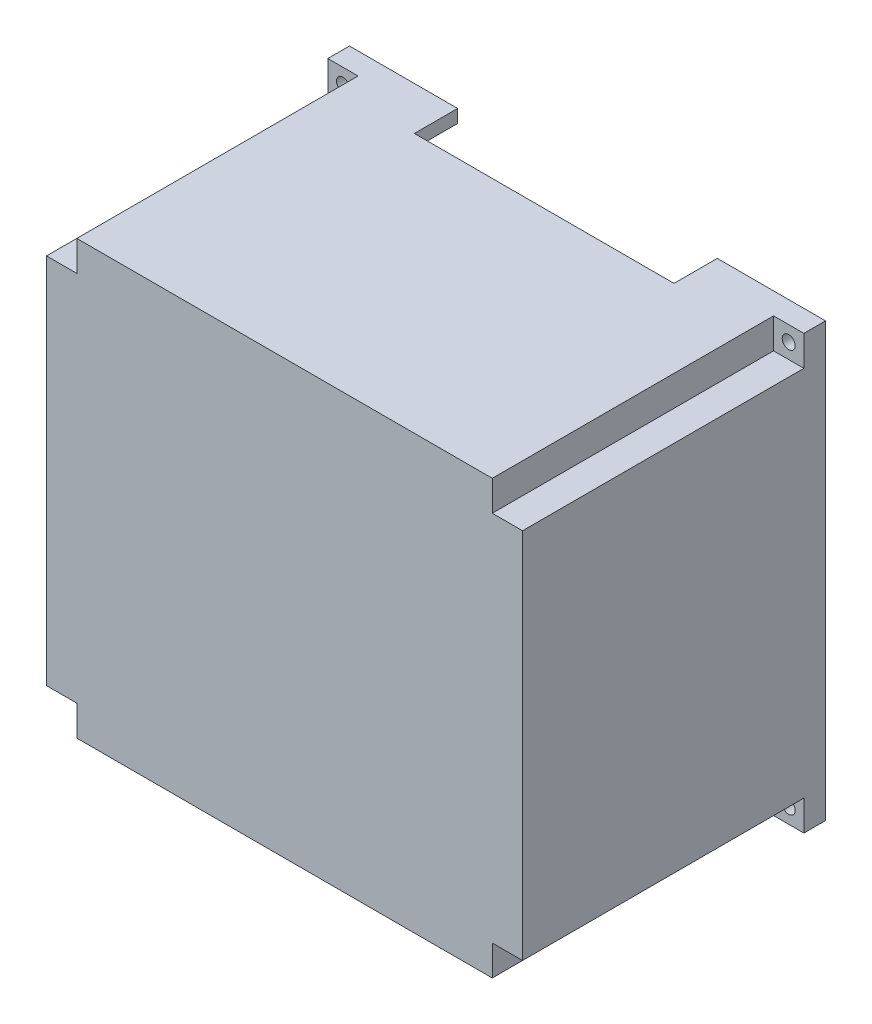
ISO-10303-21;
HEADER;
FILE_DESCRIPTION(('STEP AP214'),'2;1');
FILE_NAME('part.step','',(''),(''),'','','');
FILE_SCHEMA(('AUTOMOTIVE_DESIGN { 1 0 10303 214 1 1 1 1 }'));
ENDSEC;
DATA;
#1=APPLICATION_CONTEXT('core data for automotive mechanical design processes');
#2=APPLICATION_PROTOCOL_DEFINITION('international standard','automotive_design',2000,#1);
#3=PRODUCT_CONTEXT('',#1,'mechanical');
#4=PRODUCT('Part','Part','',(#3));
#5=PRODUCT_RELATED_PRODUCT_CATEGORY('part','',(#4));
#6=PRODUCT_DEFINITION_FORMATION('','',#4);
#7=PRODUCT_DEFINITION_CONTEXT('part definition',#1,'design');
#8=PRODUCT_DEFINITION('design','',#6,#7);
#9=PRODUCT_DEFINITION_SHAPE('','',#8);
#10=(LENGTH_UNIT() NAMED_UNIT(*) SI_UNIT(.MILLI.,.METRE.));
#11=(NAMED_UNIT(*) PLANE_ANGLE_UNIT() SI_UNIT($,.RADIAN.));
#12=(NAMED_UNIT(*) SI_UNIT($,.STERADIAN.) SOLID_ANGLE_UNIT());
#13=UNCERTAINTY_MEASURE_WITH_UNIT(LENGTH_MEASURE(1.E-05),#10,'distance_accuracy_value','');
#14=(GEOMETRIC_REPRESENTATION_CONTEXT(3) GLOBAL_UNCERTAINTY_ASSIGNED_CONTEXT((#13)) GLOBAL_UNIT_ASSIGNED_CONTEXT((#10,
#11,#12)) REPRESENTATION_CONTEXT('',''));
#15=CARTESIAN_POINT('',(0.,0.,0.));
#16=DIRECTION('',(0.,0.,1.));
#17=DIRECTION('',(1.,0.,0.));
#18=AXIS2_PLACEMENT_3D('',#15,#16,#17);
#19=CARTESIAN_POINT('',(0.,0.,-76.2));
#20=DIRECTION('',(0.,0.,-1.));
#21=DIRECTION('',(-1.,0.,0.));
#22=AXIS2_PLACEMENT_3D('',#19,#20,#21);
#23=PLANE('',#22);
#24=DIRECTION('',(0.,-1.,0.));
#25=VECTOR('',#24,1.);
#26=CARTESIAN_POINT('',(254.,76.2,-76.2));
#27=LINE('',#26,#25);
#28=CARTESIAN_POINT('',(254.,254.,-76.2));
#29=VERTEX_POINT('',#28);
#30=CARTESIAN_POINT('',(254.,76.2,-76.2));
#31=VERTEX_POINT('',#30);
#32=EDGE_CURVE('E388',#29,#31,#27,.T.);
#33=ORIENTED_EDGE('',*,*,#32,.F.);
#34=DIRECTION('',(1.,0.,0.));
#35=VECTOR('',#34,1.);
#36=CARTESIAN_POINT('',(76.2,254.,-76.2));
#37=LINE('',#36,#35);
#38=CARTESIAN_POINT('',(76.2000000000001,254.,-76.2));
#39=VERTEX_POINT('',#38);
#40=EDGE_CURVE('E381',#39,#29,#37,.T.);
#41=ORIENTED_EDGE('',*,*,#40,.F.);
#42=DIRECTION('',(0.,1.,0.));
#43=VECTOR('',#42,1.);
#44=CARTESIAN_POINT('',(76.2000000000005,2463.8,-76.2));
#45=LINE('',#44,#43);
#46=CARTESIAN_POINT('',(76.2000000000005,2286.,-76.2));
#47=VERTEX_POINT('',#46);
#48=EDGE_CURVE('E461',#39,#47,#45,.T.);
#49=ORIENTED_EDGE('',*,*,#48,.T.);
#50=DIRECTION('',(-1.,0.,0.));
#51=VECTOR('',#50,1.);
#52=CARTESIAN_POINT('',(76.2000000000005,2286.,-76.2));
#53=LINE('',#52,#51);
#54=CARTESIAN_POINT('',(254.,2286.,-76.2));
#55=VERTEX_POINT('',#54);
#56=EDGE_CURVE('E426',#55,#47,#53,.T.);
#57=ORIENTED_EDGE('',*,*,#56,.F.);
#58=DIRECTION('',(0.,-1.,0.));
#59=VECTOR('',#58,1.);
#60=CARTESIAN_POINT('',(254.,2463.8,-76.2));
#61=LINE('',#60,#59);
#62=CARTESIAN_POINT('',(254.,2463.8,-76.2));
#63=VERTEX_POINT('',#62);
#64=EDGE_CURVE('E422',#63,#55,#61,.T.);
#65=ORIENTED_EDGE('',*,*,#64,.F.);
#66=DIRECTION('',(1.,0.,0.));
#67=VECTOR('',#66,1.);
#68=CARTESIAN_POINT('',(2717.8,2463.8,-76.2));
#69=LINE('',#68,#67);
#70=CARTESIAN_POINT('',(2540.,2463.8,-76.2));
#71=VERTEX_POINT('',#70);
#72=EDGE_CURVE('E463',#63,#71,#69,.T.);
#73=ORIENTED_EDGE('',*,*,#72,.T.);
#74=DIRECTION('',(0.,1.,0.));
#75=VECTOR('',#74,1.);
#76=CARTESIAN_POINT('',(2540.,2463.8,-76.2));
#77=LINE('',#76,#75);
#78=CARTESIAN_POINT('',(2540.,2286.,-76.2));
#79=VERTEX_POINT('',#78);
#80=EDGE_CURVE('E446',#79,#71,#77,.T.);
#81=ORIENTED_EDGE('',*,*,#80,.F.);
#82=DIRECTION('',(-1.,0.,0.));
#83=VECTOR('',#82,1.);
#84=CARTESIAN_POINT('',(2717.8,2286.,-76.2));
#85=LINE('',#84,#83);
#86=CARTESIAN_POINT('',(2717.8,2286.,-76.2));
#87=VERTEX_POINT('',#86);
#88=EDGE_CURVE('E442',#87,#79,#85,.T.);
#89=ORIENTED_EDGE('',*,*,#88,.F.);
#90=DIRECTION('',(0.,-1.,0.));
#91=VECTOR('',#90,1.);
#92=CARTESIAN_POINT('',(2717.8,2463.8,-76.2));
#93=LINE('',#92,#91);
#94=CARTESIAN_POINT('',(2717.8,254.,-76.2));
#95=VERTEX_POINT('',#94);
#96=EDGE_CURVE('E466',#87,#95,#93,.T.);
#97=ORIENTED_EDGE('',*,*,#96,.T.);
#98=DIRECTION('',(1.,0.,0.));
#99=VECTOR('',#98,1.);
#100=CARTESIAN_POINT('',(2717.8,254.,-76.2));
#101=LINE('',#100,#99);
#102=CARTESIAN_POINT('',(2540.,254.,-76.2));
#103=VERTEX_POINT('',#102);
#104=EDGE_CURVE('E407',#103,#95,#101,.T.);
#105=ORIENTED_EDGE('',*,*,#104,.F.);
#106=DIRECTION('',(0.,1.,0.));
#107=VECTOR('',#106,1.);
#108=CARTESIAN_POINT('',(2540.,76.2,-76.2));
#109=LINE('',#108,#107);
#110=CARTESIAN_POINT('',(2540.,76.2,-76.2));
#111=VERTEX_POINT('',#110);
#112=EDGE_CURVE('E403',#111,#103,#109,.T.);
#113=ORIENTED_EDGE('',*,*,#112,.F.);
#114=DIRECTION('',(-1.,0.,0.));
#115=VECTOR('',#114,1.);
#116=CARTESIAN_POINT('',(2717.8,76.2,-76.2));
#117=LINE('',#116,#115);
#118=EDGE_CURVE('E469',#111,#31,#117,.T.);
#119=ORIENTED_EDGE('',*,*,#118,.T.);
#120=EDGE_LOOP('',(#33,#41,#49,#57,#65,#73,#81,#89,#97,#105,#113,#119));
#121=FACE_BOUND('',#120,.T.);
#122=ADVANCED_FACE('F36',(#121),#23,.T.);
#123=CARTESIAN_POINT('',(2717.8,76.2,-76.2));
#124=DIRECTION('',(0.,-1.,0.));
#125=DIRECTION('',(1.,0.,0.));
#126=AXIS2_PLACEMENT_3D('',#123,#124,#125);
#127=PLANE('',#126);
#128=DIRECTION('',(0.,0.,1.));
#129=VECTOR('',#128,1.);
#130=CARTESIAN_POINT('',(254.,76.2,-1778.));
#131=LINE('',#130,#129);
#132=CARTESIAN_POINT('',(254.,76.2,-1778.));
#133=VERTEX_POINT('',#132);
#134=EDGE_CURVE('E391',#133,#31,#131,.T.);
#135=ORIENTED_EDGE('',*,*,#134,.T.);
#136=ORIENTED_EDGE('',*,*,#118,.F.);
#137=DIRECTION('',(0.,0.,1.));
#138=VECTOR('',#137,1.);
#139=CARTESIAN_POINT('',(2540.,76.2,-1778.));
#140=LINE('',#139,#138);
#141=CARTESIAN_POINT('',(2540.,76.2,-1778.));
#142=VERTEX_POINT('',#141);
#143=EDGE_CURVE('E419',#142,#111,#140,.T.);
#144=ORIENTED_EDGE('',*,*,#143,.F.);
#145=DIRECTION('',(-1.,0.,0.));
#146=VECTOR('',#145,1.);
#147=CARTESIAN_POINT('',(2717.8,76.2,-1778.));
#148=LINE('',#147,#146);
#149=EDGE_CURVE('E464',#142,#133,#148,.T.);
#150=ORIENTED_EDGE('',*,*,#149,.T.);
#151=EDGE_LOOP('',(#135,#136,#144,#150));
#152=FACE_BOUND('',#151,.T.);
#153=ADVANCED_FACE('F589',(#152),#127,.F.);
#154=CARTESIAN_POINT('',(76.2000000000005,2463.8,-76.2));
#155=DIRECTION('',(-1.,0.,0.));
#156=DIRECTION('',(0.,-1.,0.));
#157=AXIS2_PLACEMENT_3D('',#154,#155,#156);
#158=PLANE('',#157);
#159=DIRECTION('',(0.,0.,1.));
#160=VECTOR('',#159,1.);
#161=CARTESIAN_POINT('',(76.2,254.,-1778.));
#162=LINE('',#161,#160);
#163=CARTESIAN_POINT('',(76.2000000000001,254.,-1778.));
#164=VERTEX_POINT('',#163);
#165=EDGE_CURVE('E400',#164,#39,#162,.T.);
#166=ORIENTED_EDGE('',*,*,#165,.F.);
#167=DIRECTION('',(0.,1.,0.));
#168=VECTOR('',#167,1.);
#169=CARTESIAN_POINT('',(76.2000000000005,2463.8,-1778.));
#170=LINE('',#169,#168);
#171=CARTESIAN_POINT('',(76.2000000000005,2286.,-1778.));
#172=VERTEX_POINT('',#171);
#173=EDGE_CURVE('E460',#164,#172,#170,.T.);
#174=ORIENTED_EDGE('',*,*,#173,.T.);
#175=DIRECTION('',(0.,0.,1.));
#176=VECTOR('',#175,1.);
#177=CARTESIAN_POINT('',(76.2000000000005,2286.,-1778.));
#178=LINE('',#177,#176);
#179=EDGE_CURVE('E429',#172,#47,#178,.T.);
#180=ORIENTED_EDGE('',*,*,#179,.T.);
#181=ORIENTED_EDGE('',*,*,#48,.F.);
#182=EDGE_LOOP('',(#166,#174,#180,#181));
#183=FACE_BOUND('',#182,.T.);
#184=ADVANCED_FACE('F578',(#183),#158,.F.);
#185=CARTESIAN_POINT('',(2717.8,2463.8,-76.2));
#186=DIRECTION('',(1.,0.,0.));
#187=DIRECTION('',(0.,1.,0.));
#188=AXIS2_PLACEMENT_3D('',#185,#186,#187);
#189=PLANE('',#188);
#190=DIRECTION('',(0.,0.,1.));
#191=VECTOR('',#190,1.);
#192=CARTESIAN_POINT('',(2717.8,254.,-1778.));
#193=LINE('',#192,#191);
#194=CARTESIAN_POINT('',(2717.8,254.,-1778.));
#195=VERTEX_POINT('',#194);
#196=EDGE_CURVE('E410',#195,#95,#193,.T.);
#197=ORIENTED_EDGE('',*,*,#196,.T.);
#198=ORIENTED_EDGE('',*,*,#96,.F.);
#199=DIRECTION('',(0.,0.,1.));
#200=VECTOR('',#199,1.);
#201=CARTESIAN_POINT('',(2717.8,2286.,-1778.));
#202=LINE('',#201,#200);
#203=CARTESIAN_POINT('',(2717.8,2286.,-1778.));
#204=VERTEX_POINT('',#203);
#205=EDGE_CURVE('E458',#204,#87,#202,.T.);
#206=ORIENTED_EDGE('',*,*,#205,.F.);
#207=DIRECTION('',(0.,-1.,0.));
#208=VECTOR('',#207,1.);
#209=CARTESIAN_POINT('',(2717.8,2463.8,-1778.));
#210=LINE('',#209,#208);
#211=EDGE_CURVE('E478',#204,#195,#210,.T.);
#212=ORIENTED_EDGE('',*,*,#211,.T.);
#213=EDGE_LOOP('',(#197,#198,#206,#212));
#214=FACE_BOUND('',#213,.T.);
#215=ADVANCED_FACE('F603',(#214),#189,.F.);
#216=CARTESIAN_POINT('',(2717.8,2463.8,-76.2));
#217=DIRECTION('',(0.,1.,0.));
#218=DIRECTION('',(0.,0.,1.));
#219=AXIS2_PLACEMENT_3D('',#216,#217,#218);
#220=PLANE('',#219);
#221=DIRECTION('',(1.,0.,0.));
#222=VECTOR('',#221,1.);
#223=CARTESIAN_POINT('',(2717.8,2463.8,-1778.));
#224=LINE('',#223,#222);
#225=CARTESIAN_POINT('',(254.,2463.8,-1778.));
#226=VERTEX_POINT('',#225);
#227=CARTESIAN_POINT('',(635.,2463.8,-1778.));
#228=VERTEX_POINT('',#227);
#229=EDGE_CURVE('E475',#226,#228,#224,.T.);
#230=ORIENTED_EDGE('',*,*,#229,.T.);
#231=DIRECTION('',(0.,0.,1.));
#232=VECTOR('',#231,1.);
#233=CARTESIAN_POINT('',(634.999999999999,2463.8,-76.200000000001));
#234=LINE('',#233,#232);
#235=CARTESIAN_POINT('',(635.,2463.8,-1524.));
#236=VERTEX_POINT('',#235);
#237=EDGE_CURVE('E280',#228,#236,#234,.T.);
#238=ORIENTED_EDGE('',*,*,#237,.T.);
#239=DIRECTION('',(1.,0.,0.));
#240=VECTOR('',#239,1.);
#241=CARTESIAN_POINT('',(2717.8,2463.8,-1524.));
#242=LINE('',#241,#240);
#243=CARTESIAN_POINT('',(2159.,2463.8,-1524.));
#244=VERTEX_POINT('',#243);
#245=EDGE_CURVE('E276',#236,#244,#242,.T.);
#246=ORIENTED_EDGE('',*,*,#245,.T.);
#247=DIRECTION('',(0.,0.,-1.));
#248=VECTOR('',#247,1.);
#249=CARTESIAN_POINT('',(2159.,2463.8,-76.2));
#250=LINE('',#249,#248);
#251=CARTESIAN_POINT('',(2159.,2463.8,-1778.));
#252=VERTEX_POINT('',#251);
#253=EDGE_CURVE('E255',#244,#252,#250,.T.);
#254=ORIENTED_EDGE('',*,*,#253,.T.);
#255=CARTESIAN_POINT('',(2540.,2463.8,-1778.));
#256=VERTEX_POINT('',#255);
#257=EDGE_CURVE('E474',#252,#256,#224,.T.);
#258=ORIENTED_EDGE('',*,*,#257,.T.);
#259=DIRECTION('',(0.,0.,1.));
#260=VECTOR('',#259,1.);
#261=CARTESIAN_POINT('',(2540.,2463.8,-1778.));
#262=LINE('',#261,#260);
#263=EDGE_CURVE('E449',#256,#71,#262,.T.);
#264=ORIENTED_EDGE('',*,*,#263,.T.);
#265=ORIENTED_EDGE('',*,*,#72,.F.);
#266=DIRECTION('',(0.,0.,1.));
#267=VECTOR('',#266,1.);
#268=CARTESIAN_POINT('',(254.,2463.8,-1778.));
#269=LINE('',#268,#267);
#270=EDGE_CURVE('E439',#226,#63,#269,.T.);
#271=ORIENTED_EDGE('',*,*,#270,.F.);
#272=EDGE_LOOP('',(#230,#238,#246,#254,#258,#264,#265,#271));
#273=FACE_BOUND('',#272,.T.);
#274=ADVANCED_FACE('F561',(#273),#220,.F.);
#275=CARTESIAN_POINT('',(0.,2540.,0.));
#276=DIRECTION('',(1.,0.,0.));
#277=DIRECTION('',(0.,0.,-1.));
#278=AXIS2_PLACEMENT_3D('',#275,#276,#277);
#279=PLANE('',#278);
#280=DIRECTION('',(0.,-1.,0.));
#281=VECTOR('',#280,1.);
#282=CARTESIAN_POINT('',(0.,0.,-1651.));
#283=LINE('',#282,#281);
#284=CARTESIAN_POINT('',(0.,177.8,-1651.));
#285=VERTEX_POINT('',#284);
#286=CARTESIAN_POINT('',(0.,0.,-1651.));
#287=VERTEX_POINT('',#286);
#288=EDGE_CURVE('E344',#285,#287,#283,.T.);
#289=ORIENTED_EDGE('',*,*,#288,.F.);
#290=DIRECTION('',(0.,0.,1.));
#291=VECTOR('',#290,1.);
#292=CARTESIAN_POINT('',(0.,177.8,-1651.));
#293=LINE('',#292,#291);
#294=CARTESIAN_POINT('',(0.,177.8,0.));
#295=VERTEX_POINT('',#294);
#296=EDGE_CURVE('E335',#285,#295,#293,.T.);
#297=ORIENTED_EDGE('',*,*,#296,.T.);
#298=DIRECTION('',(0.,-1.,0.));
#299=VECTOR('',#298,1.);
#300=CARTESIAN_POINT('',(0.,2540.,0.));
#301=LINE('',#300,#299);
#302=CARTESIAN_POINT('',(0.,2362.2,0.));
#303=VERTEX_POINT('',#302);
#304=EDGE_CURVE('E11',#303,#295,#301,.T.);
#305=ORIENTED_EDGE('',*,*,#304,.F.);
#306=DIRECTION('',(0.,0.,1.));
#307=VECTOR('',#306,1.);
#308=CARTESIAN_POINT('',(0.,2362.2,-1651.));
#309=LINE('',#308,#307);
#310=CARTESIAN_POINT('',(0.,2362.2,-1651.));
#311=VERTEX_POINT('',#310);
#312=EDGE_CURVE('E374',#311,#303,#309,.T.);
#313=ORIENTED_EDGE('',*,*,#312,.F.);
#314=DIRECTION('',(0.,-1.,0.));
#315=VECTOR('',#314,1.);
#316=CARTESIAN_POINT('',(0.,2540.,-1651.));
#317=LINE('',#316,#315);
#318=CARTESIAN_POINT('',(0.,2540.,-1651.));
#319=VERTEX_POINT('',#318);
#320=EDGE_CURVE('E365',#319,#311,#317,.T.);
#321=ORIENTED_EDGE('',*,*,#320,.F.);
#322=DIRECTION('',(0.,0.,1.));
#323=VECTOR('',#322,1.);
#324=CARTESIAN_POINT('',(0.,2540.,0.));
#325=LINE('',#324,#323);
#326=CARTESIAN_POINT('',(0.,2540.,-1778.));
#327=VERTEX_POINT('',#326);
#328=EDGE_CURVE('E481',#327,#319,#325,.T.);
#329=ORIENTED_EDGE('',*,*,#328,.F.);
#330=DIRECTION('',(0.,-1.,0.));
#331=VECTOR('',#330,1.);
#332=CARTESIAN_POINT('',(0.,2540.,-1778.));
#333=LINE('',#332,#331);
#334=CARTESIAN_POINT('',(0.,0.,-1778.));
#335=VERTEX_POINT('',#334);
#336=EDGE_CURVE('E492',#327,#335,#333,.T.);
#337=ORIENTED_EDGE('',*,*,#336,.T.);
#338=DIRECTION('',(0.,0.,1.));
#339=VECTOR('',#338,1.);
#340=CARTESIAN_POINT('',(0.,0.,0.));
#341=LINE('',#340,#339);
#342=EDGE_CURVE('E472',#335,#287,#341,.T.);
#343=ORIENTED_EDGE('',*,*,#342,.T.);
#344=EDGE_LOOP('',(#289,#297,#305,#313,#321,#329,#337,#343));
#345=FACE_BOUND('',#344,.T.);
#346=ADVANCED_FACE('F38',(#345),#279,.F.);
#347=CARTESIAN_POINT('',(0.,2540.,0.));
#348=DIRECTION('',(0.,0.,-1.));
#349=DIRECTION('',(-1.,0.,0.));
#350=AXIS2_PLACEMENT_3D('',#347,#348,#349);
#351=PLANE('',#350);
#352=DIRECTION('',(0.,-1.,0.));
#353=VECTOR('',#352,1.);
#354=CARTESIAN_POINT('',(2794.,2540.,0.));
#355=LINE('',#354,#353);
#356=CARTESIAN_POINT('',(2794.,2362.2,0.));
#357=VERTEX_POINT('',#356);
#358=CARTESIAN_POINT('',(2794.,177.8,0.));
#359=VERTEX_POINT('',#358);
#360=EDGE_CURVE('E45',#357,#359,#355,.T.);
#361=ORIENTED_EDGE('',*,*,#360,.F.);
#362=DIRECTION('',(1.,0.,0.));
#363=VECTOR('',#362,1.);
#364=CARTESIAN_POINT('',(2794.,2362.2,0.));
#365=LINE('',#364,#363);
#366=CARTESIAN_POINT('',(2616.2,2362.2,0.));
#367=VERTEX_POINT('',#366);
#368=EDGE_CURVE('E322',#367,#357,#365,.T.);
#369=ORIENTED_EDGE('',*,*,#368,.F.);
#370=DIRECTION('',(0.,-1.,0.));
#371=VECTOR('',#370,1.);
#372=CARTESIAN_POINT('',(2616.2,2540.,0.));
#373=LINE('',#372,#371);
#374=CARTESIAN_POINT('',(2616.2,2540.,0.));
#375=VERTEX_POINT('',#374);
#376=EDGE_CURVE('E332',#375,#367,#373,.T.);
#377=ORIENTED_EDGE('',*,*,#376,.F.);
#378=DIRECTION('',(1.,0.,0.));
#379=VECTOR('',#378,1.);
#380=CARTESIAN_POINT('',(0.,2540.,0.));
#381=LINE('',#380,#379);
#382=CARTESIAN_POINT('',(177.8,2540.,0.));
#383=VERTEX_POINT('',#382);
#384=EDGE_CURVE('E484',#383,#375,#381,.T.);
#385=ORIENTED_EDGE('',*,*,#384,.F.);
#386=DIRECTION('',(0.,1.,0.));
#387=VECTOR('',#386,1.);
#388=CARTESIAN_POINT('',(177.8,2540.,0.));
#389=LINE('',#388,#387);
#390=CARTESIAN_POINT('',(177.8,2362.2,0.));
#391=VERTEX_POINT('',#390);
#392=EDGE_CURVE('E369',#391,#383,#389,.T.);
#393=ORIENTED_EDGE('',*,*,#392,.F.);
#394=DIRECTION('',(1.,0.,0.));
#395=VECTOR('',#394,1.);
#396=CARTESIAN_POINT('',(0.,2362.2,0.));
#397=LINE('',#396,#395);
#398=EDGE_CURVE('E340',#303,#391,#397,.T.);
#399=ORIENTED_EDGE('',*,*,#398,.F.);
#400=ORIENTED_EDGE('',*,*,#304,.T.);
#401=DIRECTION('',(-1.,0.,0.));
#402=VECTOR('',#401,1.);
#403=CARTESIAN_POINT('',(0.,177.8,0.));
#404=LINE('',#403,#402);
#405=CARTESIAN_POINT('',(177.8,177.8,0.));
#406=VERTEX_POINT('',#405);
#407=EDGE_CURVE('E347',#406,#295,#404,.T.);
#408=ORIENTED_EDGE('',*,*,#407,.F.);
#409=DIRECTION('',(0.,1.,0.));
#410=VECTOR('',#409,1.);
#411=CARTESIAN_POINT('',(177.8,0.,0.));
#412=LINE('',#411,#410);
#413=CARTESIAN_POINT('',(177.8,0.,0.));
#414=VERTEX_POINT('',#413);
#415=EDGE_CURVE('E315',#414,#406,#412,.T.);
#416=ORIENTED_EDGE('',*,*,#415,.F.);
#417=DIRECTION('',(1.,0.,0.));
#418=VECTOR('',#417,1.);
#419=CARTESIAN_POINT('',(0.,0.,0.));
#420=LINE('',#419,#418);
#421=CARTESIAN_POINT('',(2616.2,-1.05338924276458E-13,0.));
#422=VERTEX_POINT('',#421);
#423=EDGE_CURVE('E495',#414,#422,#420,.T.);
#424=ORIENTED_EDGE('',*,*,#423,.T.);
#425=DIRECTION('',(0.,-1.,0.));
#426=VECTOR('',#425,1.);
#427=CARTESIAN_POINT('',(2616.2,-1.05338924276458E-13,0.));
#428=LINE('',#427,#426);
#429=CARTESIAN_POINT('',(2616.2,177.8,0.));
#430=VERTEX_POINT('',#429);
#431=EDGE_CURVE('E300',#430,#422,#428,.T.);
#432=ORIENTED_EDGE('',*,*,#431,.F.);
#433=DIRECTION('',(-1.,0.,0.));
#434=VECTOR('',#433,1.);
#435=CARTESIAN_POINT('',(2794.,177.8,0.));
#436=LINE('',#435,#434);
#437=EDGE_CURVE('E308',#359,#430,#436,.T.);
#438=ORIENTED_EDGE('',*,*,#437,.F.);
#439=EDGE_LOOP('',(#361,#369,#377,#385,#393,#399,#400,#408,#416,#424,#432,#438));
#440=FACE_BOUND('',#439,.T.);
#441=ADVANCED_FACE('F540',(#440),#351,.F.);
#442=CARTESIAN_POINT('',(2794.,2540.,0.));
#443=DIRECTION('',(-1.,0.,0.));
#444=DIRECTION('',(0.,0.,1.));
#445=AXIS2_PLACEMENT_3D('',#442,#443,#444);
#446=PLANE('',#445);
#447=DIRECTION('',(0.,1.,0.));
#448=VECTOR('',#447,1.);
#449=CARTESIAN_POINT('',(2794.,2540.,-1651.));
#450=LINE('',#449,#448);
#451=CARTESIAN_POINT('',(2794.,2362.2,-1651.));
#452=VERTEX_POINT('',#451);
#453=CARTESIAN_POINT('',(2794.,2540.,-1651.));
#454=VERTEX_POINT('',#453);
#455=EDGE_CURVE('E319',#452,#454,#450,.T.);
#456=ORIENTED_EDGE('',*,*,#455,.F.);
#457=DIRECTION('',(0.,0.,1.));
#458=VECTOR('',#457,1.);
#459=CARTESIAN_POINT('',(2794.,2362.2,-1651.));
#460=LINE('',#459,#458);
#461=EDGE_CURVE('E337',#452,#357,#460,.T.);
#462=ORIENTED_EDGE('',*,*,#461,.T.);
#463=ORIENTED_EDGE('',*,*,#360,.T.);
#464=DIRECTION('',(0.,0.,1.));
#465=VECTOR('',#464,1.);
#466=CARTESIAN_POINT('',(2794.,177.8,-1651.));
#467=LINE('',#466,#465);
#468=CARTESIAN_POINT('',(2794.,177.8,-1651.));
#469=VERTEX_POINT('',#468);
#470=EDGE_CURVE('E307',#469,#359,#467,.T.);
#471=ORIENTED_EDGE('',*,*,#470,.F.);
#472=DIRECTION('',(0.,1.,0.));
#473=VECTOR('',#472,1.);
#474=CARTESIAN_POINT('',(2794.,0.,-1651.));
#475=LINE('',#474,#473);
#476=CARTESIAN_POINT('',(2794.,0.,-1651.));
#477=VERTEX_POINT('',#476);
#478=EDGE_CURVE('E296',#477,#469,#475,.T.);
#479=ORIENTED_EDGE('',*,*,#478,.F.);
#480=DIRECTION('',(0.,0.,-1.));
#481=VECTOR('',#480,1.);
#482=CARTESIAN_POINT('',(2794.,0.,0.));
#483=LINE('',#482,#481);
#484=CARTESIAN_POINT('',(2794.,0.,-1778.));
#485=VERTEX_POINT('',#484);
#486=EDGE_CURVE('E498',#477,#485,#483,.T.);
#487=ORIENTED_EDGE('',*,*,#486,.T.);
#488=DIRECTION('',(0.,-1.,0.));
#489=VECTOR('',#488,1.);
#490=CARTESIAN_POINT('',(2794.,2540.,-1778.));
#491=LINE('',#490,#489);
#492=CARTESIAN_POINT('',(2794.,2540.,-1778.));
#493=VERTEX_POINT('',#492);
#494=EDGE_CURVE('E503',#493,#485,#491,.T.);
#495=ORIENTED_EDGE('',*,*,#494,.F.);
#496=DIRECTION('',(0.,0.,-1.));
#497=VECTOR('',#496,1.);
#498=CARTESIAN_POINT('',(2794.,2540.,0.));
#499=LINE('',#498,#497);
#500=EDGE_CURVE('E488',#454,#493,#499,.T.);
#501=ORIENTED_EDGE('',*,*,#500,.F.);
#502=EDGE_LOOP('',(#456,#462,#463,#471,#479,#487,#495,#501));
#503=FACE_BOUND('',#502,.T.);
#504=ADVANCED_FACE('F534',(#503),#446,.F.);
#505=CARTESIAN_POINT('',(0.,2540.,-1778.));
#506=DIRECTION('',(0.,0.,1.));
#507=DIRECTION('',(1.,0.,0.));
#508=AXIS2_PLACEMENT_3D('',#505,#506,#507);
#509=PLANE('',#508);
#510=CARTESIAN_POINT('',(2705.1,88.9,-1778.));
#511=DIRECTION('',(0.,0.,-1.));
#512=DIRECTION('',(-1.,0.,0.));
#513=AXIS2_PLACEMENT_3D('',#510,#511,#512);
#514=CIRCLE('',#513,38.1000000000001);
#515=CARTESIAN_POINT('',(2667.,88.9,-1778.));
#516=VERTEX_POINT('',#515);
#517=EDGE_CURVE('E287',#516,#516,#514,.T.);
#518=ORIENTED_EDGE('',*,*,#517,.F.);
#519=EDGE_LOOP('',(#518));
#520=FACE_BOUND('',#519,.T.);
#521=CARTESIAN_POINT('',(88.9000000000004,2451.1,-1778.));
#522=DIRECTION('',(0.,0.,-1.));
#523=DIRECTION('',(-1.,0.,0.));
#524=AXIS2_PLACEMENT_3D('',#521,#522,#523);
#525=CIRCLE('',#524,38.1);
#526=CARTESIAN_POINT('',(50.8000000000005,2451.1,-1778.));
#527=VERTEX_POINT('',#526);
#528=EDGE_CURVE('E286',#527,#527,#525,.T.);
#529=ORIENTED_EDGE('',*,*,#528,.F.);
#530=EDGE_LOOP('',(#529));
#531=FACE_BOUND('',#530,.T.);
#532=CARTESIAN_POINT('',(88.9,88.9,-1778.));
#533=DIRECTION('',(0.,0.,-1.));
#534=DIRECTION('',(-1.,0.,0.));
#535=AXIS2_PLACEMENT_3D('',#532,#533,#534);
#536=CIRCLE('',#535,38.1);
#537=CARTESIAN_POINT('',(50.8,88.9,-1778.));
#538=VERTEX_POINT('',#537);
#539=EDGE_CURVE('E283',#538,#538,#536,.T.);
#540=ORIENTED_EDGE('',*,*,#539,.F.);
#541=EDGE_LOOP('',(#540));
#542=FACE_BOUND('',#541,.T.);
#543=CARTESIAN_POINT('',(2705.1,2451.1,-1778.));
#544=DIRECTION('',(0.,0.,-1.));
#545=DIRECTION('',(-1.,0.,0.));
#546=AXIS2_PLACEMENT_3D('',#543,#544,#545);
#547=CIRCLE('',#546,38.1000000000001);
#548=CARTESIAN_POINT('',(2667.,2451.1,-1778.));
#549=VERTEX_POINT('',#548);
#550=EDGE_CURVE('E290',#549,#549,#547,.T.);
#551=ORIENTED_EDGE('',*,*,#550,.F.);
#552=EDGE_LOOP('',(#551));
#553=FACE_BOUND('',#552,.T.);
#554=DIRECTION('',(-1.,0.,0.));
#555=VECTOR('',#554,1.);
#556=CARTESIAN_POINT('',(0.,2540.,-1778.));
#557=LINE('',#556,#555);
#558=CARTESIAN_POINT('',(635.,2540.,-1778.));
#559=VERTEX_POINT('',#558);
#560=EDGE_CURVE('E490',#559,#327,#557,.T.);
#561=ORIENTED_EDGE('',*,*,#560,.F.);
#562=DIRECTION('',(0.,1.,0.));
#563=VECTOR('',#562,1.);
#564=CARTESIAN_POINT('',(635.,2286.,-1778.));
#565=LINE('',#564,#563);
#566=EDGE_CURVE('E274',#228,#559,#565,.T.);
#567=ORIENTED_EDGE('',*,*,#566,.F.);
#568=ORIENTED_EDGE('',*,*,#229,.F.);
#569=DIRECTION('',(0.,-1.,0.));
#570=VECTOR('',#569,1.);
#571=CARTESIAN_POINT('',(254.,2463.8,-1778.));
#572=LINE('',#571,#570);
#573=CARTESIAN_POINT('',(254.,2286.,-1778.));
#574=VERTEX_POINT('',#573);
#575=EDGE_CURVE('E423',#226,#574,#572,.T.);
#576=ORIENTED_EDGE('',*,*,#575,.T.);
#577=DIRECTION('',(-1.,0.,0.));
#578=VECTOR('',#577,1.);
#579=CARTESIAN_POINT('',(76.2000000000005,2286.,-1778.));
#580=LINE('',#579,#578);
#581=EDGE_CURVE('E425',#574,#172,#580,.T.);
#582=ORIENTED_EDGE('',*,*,#581,.T.);
#583=ORIENTED_EDGE('',*,*,#173,.F.);
#584=DIRECTION('',(1.,0.,0.));
#585=VECTOR('',#584,1.);
#586=CARTESIAN_POINT('',(76.2,254.,-1778.));
#587=LINE('',#586,#585);
#588=CARTESIAN_POINT('',(254.,254.,-1778.));
#589=VERTEX_POINT('',#588);
#590=EDGE_CURVE('E385',#164,#589,#587,.T.);
#591=ORIENTED_EDGE('',*,*,#590,.T.);
#592=DIRECTION('',(0.,-1.,0.));
#593=VECTOR('',#592,1.);
#594=CARTESIAN_POINT('',(254.,76.2,-1778.));
#595=LINE('',#594,#593);
#596=EDGE_CURVE('E387',#589,#133,#595,.T.);
#597=ORIENTED_EDGE('',*,*,#596,.T.);
#598=ORIENTED_EDGE('',*,*,#149,.F.);
#599=DIRECTION('',(0.,1.,0.));
#600=VECTOR('',#599,1.);
#601=CARTESIAN_POINT('',(2540.,76.2,-1778.));
#602=LINE('',#601,#600);
#603=CARTESIAN_POINT('',(2540.,254.,-1778.));
#604=VERTEX_POINT('',#603);
#605=EDGE_CURVE('E404',#142,#604,#602,.T.);
#606=ORIENTED_EDGE('',*,*,#605,.T.);
#607=DIRECTION('',(1.,0.,0.));
#608=VECTOR('',#607,1.);
#609=CARTESIAN_POINT('',(2717.8,254.,-1778.));
#610=LINE('',#609,#608);
#611=EDGE_CURVE('E406',#604,#195,#610,.T.);
#612=ORIENTED_EDGE('',*,*,#611,.T.);
#613=ORIENTED_EDGE('',*,*,#211,.F.);
#614=DIRECTION('',(-1.,0.,0.));
#615=VECTOR('',#614,1.);
#616=CARTESIAN_POINT('',(2717.8,2286.,-1778.));
#617=LINE('',#616,#615);
#618=CARTESIAN_POINT('',(2540.,2286.,-1778.));
#619=VERTEX_POINT('',#618);
#620=EDGE_CURVE('E443',#204,#619,#617,.T.);
#621=ORIENTED_EDGE('',*,*,#620,.T.);
#622=DIRECTION('',(0.,1.,0.));
#623=VECTOR('',#622,1.);
#624=CARTESIAN_POINT('',(2540.,2463.8,-1778.));
#625=LINE('',#624,#623);
#626=EDGE_CURVE('E445',#619,#256,#625,.T.);
#627=ORIENTED_EDGE('',*,*,#626,.T.);
#628=ORIENTED_EDGE('',*,*,#257,.F.);
#629=DIRECTION('',(0.,1.,0.));
#630=VECTOR('',#629,1.);
#631=CARTESIAN_POINT('',(2159.,2286.,-1778.));
#632=LINE('',#631,#630);
#633=CARTESIAN_POINT('',(2159.,2540.,-1778.));
#634=VERTEX_POINT('',#633);
#635=EDGE_CURVE('E258',#252,#634,#632,.T.);
#636=ORIENTED_EDGE('',*,*,#635,.T.);
#637=EDGE_CURVE('E269',#493,#634,#557,.T.);
#638=ORIENTED_EDGE('',*,*,#637,.F.);
#639=ORIENTED_EDGE('',*,*,#494,.T.);
#640=DIRECTION('',(-1.,0.,0.));
#641=VECTOR('',#640,1.);
#642=CARTESIAN_POINT('',(0.,0.,-1778.));
#643=LINE('',#642,#641);
#644=EDGE_CURVE('E485',#485,#335,#643,.T.);
#645=ORIENTED_EDGE('',*,*,#644,.T.);
#646=ORIENTED_EDGE('',*,*,#336,.F.);
#647=EDGE_LOOP('',(#561,#567,#568,#576,#582,#583,#591,#597,#598,#606,#612,#613,#621,#627,#628,
#636,#638,#639,#645,#646));
#648=FACE_BOUND('',#647,.T.);
#649=ADVANCED_FACE('F557',(#520,#531,#542,#553,#648),#509,.F.);
#650=CARTESIAN_POINT('',(0.,2540.,0.));
#651=DIRECTION('',(0.,-1.,0.));
#652=DIRECTION('',(0.,0.,-1.));
#653=AXIS2_PLACEMENT_3D('',#650,#651,#652);
#654=PLANE('',#653);
#655=DIRECTION('',(1.,0.,0.));
#656=VECTOR('',#655,1.);
#657=CARTESIAN_POINT('',(635.,2540.,-1524.));
#658=LINE('',#657,#656);
#659=CARTESIAN_POINT('',(635.,2540.,-1524.));
#660=VERTEX_POINT('',#659);
#661=CARTESIAN_POINT('',(2159.,2540.,-1524.));
#662=VERTEX_POINT('',#661);
#663=EDGE_CURVE('E262',#660,#662,#658,.T.);
#664=ORIENTED_EDGE('',*,*,#663,.F.);
#665=DIRECTION('',(0.,0.,1.));
#666=VECTOR('',#665,1.);
#667=CARTESIAN_POINT('',(635.,2540.,-1778.));
#668=LINE('',#667,#666);
#669=EDGE_CURVE('E53',#559,#660,#668,.T.);
#670=ORIENTED_EDGE('',*,*,#669,.F.);
#671=ORIENTED_EDGE('',*,*,#560,.T.);
#672=ORIENTED_EDGE('',*,*,#328,.T.);
#673=DIRECTION('',(-1.,0.,0.));
#674=VECTOR('',#673,1.);
#675=CARTESIAN_POINT('',(0.,2540.,-1651.));
#676=LINE('',#675,#674);
#677=CARTESIAN_POINT('',(177.8,2540.,-1651.));
#678=VERTEX_POINT('',#677);
#679=EDGE_CURVE('E372',#678,#319,#676,.T.);
#680=ORIENTED_EDGE('',*,*,#679,.F.);
#681=DIRECTION('',(0.,0.,1.));
#682=VECTOR('',#681,1.);
#683=CARTESIAN_POINT('',(177.8,2540.,-1651.));
#684=LINE('',#683,#682);
#685=EDGE_CURVE('E378',#678,#383,#684,.T.);
#686=ORIENTED_EDGE('',*,*,#685,.T.);
#687=ORIENTED_EDGE('',*,*,#384,.T.);
#688=DIRECTION('',(0.,0.,1.));
#689=VECTOR('',#688,1.);
#690=CARTESIAN_POINT('',(2616.2,2540.,-1651.));
#691=LINE('',#690,#689);
#692=CARTESIAN_POINT('',(2616.2,2540.,-1651.));
#693=VERTEX_POINT('',#692);
#694=EDGE_CURVE('E331',#693,#375,#691,.T.);
#695=ORIENTED_EDGE('',*,*,#694,.F.);
#696=DIRECTION('',(-1.,0.,0.));
#697=VECTOR('',#696,1.);
#698=CARTESIAN_POINT('',(2794.,2540.,-1651.));
#699=LINE('',#698,#697);
#700=EDGE_CURVE('E321',#454,#693,#699,.T.);
#701=ORIENTED_EDGE('',*,*,#700,.F.);
#702=ORIENTED_EDGE('',*,*,#500,.T.);
#703=ORIENTED_EDGE('',*,*,#637,.T.);
#704=DIRECTION('',(0.,0.,-1.));
#705=VECTOR('',#704,1.);
#706=CARTESIAN_POINT('',(2159.,2540.,-1778.));
#707=LINE('',#706,#705);
#708=EDGE_CURVE('E252',#662,#634,#707,.T.);
#709=ORIENTED_EDGE('',*,*,#708,.F.);
#710=EDGE_LOOP('',(#664,#670,#671,#672,#680,#686,#687,#695,#701,#702,#703,#709));
#711=FACE_BOUND('',#710,.T.);
#712=ADVANCED_FACE('F267',(#711),#654,.F.);
#713=CARTESIAN_POINT('',(0.,0.,0.));
#714=DIRECTION('',(0.,-1.,0.));
#715=DIRECTION('',(0.,0.,-1.));
#716=AXIS2_PLACEMENT_3D('',#713,#714,#715);
#717=PLANE('',#716);
#718=DIRECTION('',(0.,0.,1.));
#719=VECTOR('',#718,1.);
#720=CARTESIAN_POINT('',(177.8,0.,-1651.));
#721=LINE('',#720,#719);
#722=CARTESIAN_POINT('',(177.8,0.,-1651.));
#723=VERTEX_POINT('',#722);
#724=EDGE_CURVE('E356',#723,#414,#721,.T.);
#725=ORIENTED_EDGE('',*,*,#724,.F.);
#726=DIRECTION('',(1.,0.,0.));
#727=VECTOR('',#726,1.);
#728=CARTESIAN_POINT('',(0.,0.,-1651.));
#729=LINE('',#728,#727);
#730=EDGE_CURVE('E346',#287,#723,#729,.T.);
#731=ORIENTED_EDGE('',*,*,#730,.F.);
#732=ORIENTED_EDGE('',*,*,#342,.F.);
#733=ORIENTED_EDGE('',*,*,#644,.F.);
#734=ORIENTED_EDGE('',*,*,#486,.F.);
#735=DIRECTION('',(1.,0.,0.));
#736=VECTOR('',#735,1.);
#737=CARTESIAN_POINT('',(2794.,0.,-1651.));
#738=LINE('',#737,#736);
#739=CARTESIAN_POINT('',(2616.2,0.,-1651.));
#740=VERTEX_POINT('',#739);
#741=EDGE_CURVE('E305',#740,#477,#738,.T.);
#742=ORIENTED_EDGE('',*,*,#741,.F.);
#743=DIRECTION('',(0.,0.,1.));
#744=VECTOR('',#743,1.);
#745=CARTESIAN_POINT('',(2616.2,-1.05338924276458E-13,-1651.));
#746=LINE('',#745,#744);
#747=EDGE_CURVE('E312',#740,#422,#746,.T.);
#748=ORIENTED_EDGE('',*,*,#747,.T.);
#749=ORIENTED_EDGE('',*,*,#423,.F.);
#750=EDGE_LOOP('',(#725,#731,#732,#733,#734,#742,#748,#749));
#751=FACE_BOUND('',#750,.T.);
#752=ADVANCED_FACE('F550',(#751),#717,.T.);
#753=CARTESIAN_POINT('',(2717.8,2286.,-1778.));
#754=DIRECTION('',(0.,1.,0.));
#755=DIRECTION('',(0.,0.,1.));
#756=AXIS2_PLACEMENT_3D('',#753,#754,#755);
#757=PLANE('',#756);
#758=ORIENTED_EDGE('',*,*,#88,.T.);
#759=DIRECTION('',(0.,0.,1.));
#760=VECTOR('',#759,1.);
#761=CARTESIAN_POINT('',(2540.,2286.,-1778.));
#762=LINE('',#761,#760);
#763=EDGE_CURVE('E456',#619,#79,#762,.T.);
#764=ORIENTED_EDGE('',*,*,#763,.F.);
#765=ORIENTED_EDGE('',*,*,#620,.F.);
#766=ORIENTED_EDGE('',*,*,#205,.T.);
#767=EDGE_LOOP('',(#758,#764,#765,#766));
#768=FACE_BOUND('',#767,.T.);
#769=ADVANCED_FACE('F607',(#768),#757,.F.);
#770=CARTESIAN_POINT('',(2540.,2463.8,-1778.));
#771=DIRECTION('',(1.,0.,0.));
#772=DIRECTION('',(0.,0.,-1.));
#773=AXIS2_PLACEMENT_3D('',#770,#771,#772);
#774=PLANE('',#773);
#775=ORIENTED_EDGE('',*,*,#80,.T.);
#776=ORIENTED_EDGE('',*,*,#263,.F.);
#777=ORIENTED_EDGE('',*,*,#626,.F.);
#778=ORIENTED_EDGE('',*,*,#763,.T.);
#779=EDGE_LOOP('',(#775,#776,#777,#778));
#780=FACE_BOUND('',#779,.T.);
#781=ADVANCED_FACE('F611',(#780),#774,.F.);
#782=CARTESIAN_POINT('',(254.,2463.8,-1778.));
#783=DIRECTION('',(-1.,0.,0.));
#784=DIRECTION('',(0.,0.,1.));
#785=AXIS2_PLACEMENT_3D('',#782,#783,#784);
#786=PLANE('',#785);
#787=ORIENTED_EDGE('',*,*,#64,.T.);
#788=DIRECTION('',(0.,0.,1.));
#789=VECTOR('',#788,1.);
#790=CARTESIAN_POINT('',(254.,2286.,-1778.));
#791=LINE('',#790,#789);
#792=EDGE_CURVE('E436',#574,#55,#791,.T.);
#793=ORIENTED_EDGE('',*,*,#792,.F.);
#794=ORIENTED_EDGE('',*,*,#575,.F.);
#795=ORIENTED_EDGE('',*,*,#270,.T.);
#796=EDGE_LOOP('',(#787,#793,#794,#795));
#797=FACE_BOUND('',#796,.T.);
#798=ADVANCED_FACE('F568',(#797),#786,.F.);
#799=CARTESIAN_POINT('',(76.2000000000005,2286.,-1778.));
#800=DIRECTION('',(0.,1.,0.));
#801=DIRECTION('',(0.,0.,1.));
#802=AXIS2_PLACEMENT_3D('',#799,#800,#801);
#803=PLANE('',#802);
#804=ORIENTED_EDGE('',*,*,#56,.T.);
#805=ORIENTED_EDGE('',*,*,#179,.F.);
#806=ORIENTED_EDGE('',*,*,#581,.F.);
#807=ORIENTED_EDGE('',*,*,#792,.T.);
#808=EDGE_LOOP('',(#804,#805,#806,#807));
#809=FACE_BOUND('',#808,.T.);
#810=ADVANCED_FACE('F575',(#809),#803,.F.);
#811=CARTESIAN_POINT('',(2540.,76.2,-1778.));
#812=DIRECTION('',(1.,0.,0.));
#813=DIRECTION('',(0.,0.,-1.));
#814=AXIS2_PLACEMENT_3D('',#811,#812,#813);
#815=PLANE('',#814);
#816=ORIENTED_EDGE('',*,*,#112,.T.);
#817=DIRECTION('',(0.,0.,1.));
#818=VECTOR('',#817,1.);
#819=CARTESIAN_POINT('',(2540.,254.,-1778.));
#820=LINE('',#819,#818);
#821=EDGE_CURVE('E416',#604,#103,#820,.T.);
#822=ORIENTED_EDGE('',*,*,#821,.F.);
#823=ORIENTED_EDGE('',*,*,#605,.F.);
#824=ORIENTED_EDGE('',*,*,#143,.T.);
#825=EDGE_LOOP('',(#816,#822,#823,#824));
#826=FACE_BOUND('',#825,.T.);
#827=ADVANCED_FACE('F593',(#826),#815,.F.);
#828=CARTESIAN_POINT('',(2717.8,254.,-1778.));
#829=DIRECTION('',(0.,-1.,0.));
#830=DIRECTION('',(0.,0.,-1.));
#831=AXIS2_PLACEMENT_3D('',#828,#829,#830);
#832=PLANE('',#831);
#833=ORIENTED_EDGE('',*,*,#104,.T.);
#834=ORIENTED_EDGE('',*,*,#196,.F.);
#835=ORIENTED_EDGE('',*,*,#611,.F.);
#836=ORIENTED_EDGE('',*,*,#821,.T.);
#837=EDGE_LOOP('',(#833,#834,#835,#836));
#838=FACE_BOUND('',#837,.T.);
#839=ADVANCED_FACE('F597',(#838),#832,.F.);
#840=CARTESIAN_POINT('',(76.2,254.,-1778.));
#841=DIRECTION('',(0.,-1.,0.));
#842=DIRECTION('',(0.,0.,-1.));
#843=AXIS2_PLACEMENT_3D('',#840,#841,#842);
#844=PLANE('',#843);
#845=ORIENTED_EDGE('',*,*,#40,.T.);
#846=DIRECTION('',(0.,0.,1.));
#847=VECTOR('',#846,1.);
#848=CARTESIAN_POINT('',(254.,254.,-1778.));
#849=LINE('',#848,#847);
#850=EDGE_CURVE('E397',#589,#29,#849,.T.);
#851=ORIENTED_EDGE('',*,*,#850,.F.);
#852=ORIENTED_EDGE('',*,*,#590,.F.);
#853=ORIENTED_EDGE('',*,*,#165,.T.);
#854=EDGE_LOOP('',(#845,#851,#852,#853));
#855=FACE_BOUND('',#854,.T.);
#856=ADVANCED_FACE('F580',(#855),#844,.F.);
#857=CARTESIAN_POINT('',(254.,76.2,-1778.));
#858=DIRECTION('',(-1.,0.,0.));
#859=DIRECTION('',(0.,0.,1.));
#860=AXIS2_PLACEMENT_3D('',#857,#858,#859);
#861=PLANE('',#860);
#862=ORIENTED_EDGE('',*,*,#32,.T.);
#863=ORIENTED_EDGE('',*,*,#134,.F.);
#864=ORIENTED_EDGE('',*,*,#596,.F.);
#865=ORIENTED_EDGE('',*,*,#850,.T.);
#866=EDGE_LOOP('',(#862,#863,#864,#865));
#867=FACE_BOUND('',#866,.T.);
#868=ADVANCED_FACE('F586',(#867),#861,.F.);
#869=CARTESIAN_POINT('',(2616.2,-1.05338924276458E-13,-1651.));
#870=DIRECTION('',(-1.,0.,0.));
#871=DIRECTION('',(0.,0.,1.));
#872=AXIS2_PLACEMENT_3D('',#869,#870,#871);
#873=PLANE('',#872);
#874=ORIENTED_EDGE('',*,*,#431,.T.);
#875=ORIENTED_EDGE('',*,*,#747,.F.);
#876=DIRECTION('',(0.,-1.,0.));
#877=VECTOR('',#876,1.);
#878=CARTESIAN_POINT('',(2616.2,-1.05338924276458E-13,-1651.));
#879=LINE('',#878,#877);
#880=CARTESIAN_POINT('',(2616.2,177.8,-1651.));
#881=VERTEX_POINT('',#880);
#882=EDGE_CURVE('E303',#881,#740,#879,.T.);
#883=ORIENTED_EDGE('',*,*,#882,.F.);
#884=DIRECTION('',(0.,0.,1.));
#885=VECTOR('',#884,1.);
#886=CARTESIAN_POINT('',(2616.2,177.8,-1651.));
#887=LINE('',#886,#885);
#888=EDGE_CURVE('E316',#881,#430,#887,.T.);
#889=ORIENTED_EDGE('',*,*,#888,.T.);
#890=EDGE_LOOP('',(#874,#875,#883,#889));
#891=FACE_BOUND('',#890,.T.);
#892=ADVANCED_FACE('F546',(#891),#873,.F.);
#893=CARTESIAN_POINT('',(2794.,177.8,-1651.));
#894=DIRECTION('',(0.,1.,0.));
#895=DIRECTION('',(-1.,0.,0.));
#896=AXIS2_PLACEMENT_3D('',#893,#894,#895);
#897=PLANE('',#896);
#898=ORIENTED_EDGE('',*,*,#437,.T.);
#899=ORIENTED_EDGE('',*,*,#888,.F.);
#900=DIRECTION('',(-1.,0.,0.));
#901=VECTOR('',#900,1.);
#902=CARTESIAN_POINT('',(2794.,177.8,-1651.));
#903=LINE('',#902,#901);
#904=EDGE_CURVE('E299',#469,#881,#903,.T.);
#905=ORIENTED_EDGE('',*,*,#904,.F.);
#906=ORIENTED_EDGE('',*,*,#470,.T.);
#907=EDGE_LOOP('',(#898,#899,#905,#906));
#908=FACE_BOUND('',#907,.T.);
#909=ADVANCED_FACE('F526',(#908),#897,.F.);
#910=CARTESIAN_POINT('',(0.,0.,-1651.));
#911=DIRECTION('',(0.,0.,1.));
#912=DIRECTION('',(1.,0.,0.));
#913=AXIS2_PLACEMENT_3D('',#910,#911,#912);
#914=PLANE('',#913);
#915=CARTESIAN_POINT('',(2705.1,88.9,-1651.));
#916=DIRECTION('',(0.,0.,1.));
#917=DIRECTION('',(1.,0.,0.));
#918=AXIS2_PLACEMENT_3D('',#915,#916,#917);
#919=CIRCLE('',#918,38.1000000000001);
#920=CARTESIAN_POINT('',(2743.2,88.9,-1651.));
#921=VERTEX_POINT('',#920);
#922=EDGE_CURVE('E40',#921,#921,#919,.T.);
#923=ORIENTED_EDGE('',*,*,#922,.F.);
#924=EDGE_LOOP('',(#923));
#925=FACE_BOUND('',#924,.T.);
#926=ORIENTED_EDGE('',*,*,#478,.T.);
#927=ORIENTED_EDGE('',*,*,#904,.T.);
#928=ORIENTED_EDGE('',*,*,#882,.T.);
#929=ORIENTED_EDGE('',*,*,#741,.T.);
#930=EDGE_LOOP('',(#926,#927,#928,#929));
#931=FACE_BOUND('',#930,.T.);
#932=ADVANCED_FACE('F522',(#925,#931),#914,.T.);
#933=CARTESIAN_POINT('',(0.,177.8,-1651.));
#934=DIRECTION('',(0.,1.,0.));
#935=DIRECTION('',(-1.,0.,0.));
#936=AXIS2_PLACEMENT_3D('',#933,#934,#935);
#937=PLANE('',#936);
#938=ORIENTED_EDGE('',*,*,#407,.T.);
#939=ORIENTED_EDGE('',*,*,#296,.F.);
#940=DIRECTION('',(-1.,0.,0.));
#941=VECTOR('',#940,1.);
#942=CARTESIAN_POINT('',(0.,177.8,-1651.));
#943=LINE('',#942,#941);
#944=CARTESIAN_POINT('',(177.8,177.8,-1651.));
#945=VERTEX_POINT('',#944);
#946=EDGE_CURVE('E353',#945,#285,#943,.T.);
#947=ORIENTED_EDGE('',*,*,#946,.F.);
#948=DIRECTION('',(0.,0.,1.));
#949=VECTOR('',#948,1.);
#950=CARTESIAN_POINT('',(177.8,177.8,-1651.));
#951=LINE('',#950,#949);
#952=EDGE_CURVE('E362',#945,#406,#951,.T.);
#953=ORIENTED_EDGE('',*,*,#952,.T.);
#954=EDGE_LOOP('',(#938,#939,#947,#953));
#955=FACE_BOUND('',#954,.T.);
#956=ADVANCED_FACE('F525',(#955),#937,.F.);
#957=CARTESIAN_POINT('',(177.8,0.,-1651.));
#958=DIRECTION('',(1.,0.,0.));
#959=DIRECTION('',(0.,1.,0.));
#960=AXIS2_PLACEMENT_3D('',#957,#958,#959);
#961=PLANE('',#960);
#962=ORIENTED_EDGE('',*,*,#415,.T.);
#963=ORIENTED_EDGE('',*,*,#952,.F.);
#964=DIRECTION('',(0.,1.,0.));
#965=VECTOR('',#964,1.);
#966=CARTESIAN_POINT('',(177.8,0.,-1651.));
#967=LINE('',#966,#965);
#968=EDGE_CURVE('E350',#723,#945,#967,.T.);
#969=ORIENTED_EDGE('',*,*,#968,.F.);
#970=ORIENTED_EDGE('',*,*,#724,.T.);
#971=EDGE_LOOP('',(#962,#963,#969,#970));
#972=FACE_BOUND('',#971,.T.);
#973=ADVANCED_FACE('F656',(#972),#961,.F.);
#974=CARTESIAN_POINT('',(0.,0.,-1651.));
#975=DIRECTION('',(0.,0.,-1.));
#976=DIRECTION('',(-1.,0.,0.));
#977=AXIS2_PLACEMENT_3D('',#974,#975,#976);
#978=PLANE('',#977);
#979=CARTESIAN_POINT('',(88.9,88.9,-1651.));
#980=DIRECTION('',(0.,0.,-1.));
#981=DIRECTION('',(-1.,0.,0.));
#982=AXIS2_PLACEMENT_3D('',#979,#980,#981);
#983=CIRCLE('',#982,38.1);
#984=CARTESIAN_POINT('',(50.8,88.9,-1651.));
#985=VERTEX_POINT('',#984);
#986=EDGE_CURVE('E512',#985,#985,#983,.T.);
#987=ORIENTED_EDGE('',*,*,#986,.T.);
#988=EDGE_LOOP('',(#987));
#989=FACE_BOUND('',#988,.T.);
#990=ORIENTED_EDGE('',*,*,#288,.T.);
#991=ORIENTED_EDGE('',*,*,#730,.T.);
#992=ORIENTED_EDGE('',*,*,#968,.T.);
#993=ORIENTED_EDGE('',*,*,#946,.T.);
#994=EDGE_LOOP('',(#990,#991,#992,#993));
#995=FACE_BOUND('',#994,.T.);
#996=ADVANCED_FACE('F653',(#989,#995),#978,.F.);
#997=CARTESIAN_POINT('',(177.8,2540.,-1651.));
#998=DIRECTION('',(1.,0.,0.));
#999=DIRECTION('',(0.,1.,0.));
#1000=AXIS2_PLACEMENT_3D('',#997,#998,#999);
#1001=PLANE('',#1000);
#1002=ORIENTED_EDGE('',*,*,#392,.T.);
#1003=ORIENTED_EDGE('',*,*,#685,.F.);
#1004=DIRECTION('',(0.,1.,0.));
#1005=VECTOR('',#1004,1.);
#1006=CARTESIAN_POINT('',(177.8,2540.,-1651.));
#1007=LINE('',#1006,#1005);
#1008=CARTESIAN_POINT('',(177.8,2362.2,-1651.));
#1009=VERTEX_POINT('',#1008);
#1010=EDGE_CURVE('E61',#1009,#678,#1007,.T.);
#1011=ORIENTED_EDGE('',*,*,#1010,.F.);
#1012=DIRECTION('',(0.,0.,1.));
#1013=VECTOR('',#1012,1.);
#1014=CARTESIAN_POINT('',(177.8,2362.2,-1651.));
#1015=LINE('',#1014,#1013);
#1016=EDGE_CURVE('E382',#1009,#391,#1015,.T.);
#1017=ORIENTED_EDGE('',*,*,#1016,.T.);
#1018=EDGE_LOOP('',(#1002,#1003,#1011,#1017));
#1019=FACE_BOUND('',#1018,.T.);
#1020=ADVANCED_FACE('F675',(#1019),#1001,.F.);
#1021=CARTESIAN_POINT('',(0.,2362.2,-1651.));
#1022=DIRECTION('',(0.,-1.,0.));
#1023=DIRECTION('',(0.,0.,-1.));
#1024=AXIS2_PLACEMENT_3D('',#1021,#1022,#1023);
#1025=PLANE('',#1024);
#1026=ORIENTED_EDGE('',*,*,#398,.T.);
#1027=ORIENTED_EDGE('',*,*,#1016,.F.);
#1028=DIRECTION('',(1.,0.,0.));
#1029=VECTOR('',#1028,1.);
#1030=CARTESIAN_POINT('',(0.,2362.2,-1651.));
#1031=LINE('',#1030,#1029);
#1032=EDGE_CURVE('E368',#311,#1009,#1031,.T.);
#1033=ORIENTED_EDGE('',*,*,#1032,.F.);
#1034=ORIENTED_EDGE('',*,*,#312,.T.);
#1035=EDGE_LOOP('',(#1026,#1027,#1033,#1034));
#1036=FACE_BOUND('',#1035,.T.);
#1037=ADVANCED_FACE('F673',(#1036),#1025,.F.);
#1038=CARTESIAN_POINT('',(0.,0.,-1651.));
#1039=DIRECTION('',(0.,0.,1.));
#1040=DIRECTION('',(1.,0.,0.));
#1041=AXIS2_PLACEMENT_3D('',#1038,#1039,#1040);
#1042=PLANE('',#1041);
#1043=CARTESIAN_POINT('',(88.9000000000004,2451.1,-1651.));
#1044=DIRECTION('',(0.,0.,1.));
#1045=DIRECTION('',(1.,0.,0.));
#1046=AXIS2_PLACEMENT_3D('',#1043,#1044,#1045);
#1047=CIRCLE('',#1046,38.1);
#1048=CARTESIAN_POINT('',(127.,2451.1,-1651.));
#1049=VERTEX_POINT('',#1048);
#1050=EDGE_CURVE('E510',#1049,#1049,#1047,.T.);
#1051=ORIENTED_EDGE('',*,*,#1050,.F.);
#1052=EDGE_LOOP('',(#1051));
#1053=FACE_BOUND('',#1052,.T.);
#1054=ORIENTED_EDGE('',*,*,#320,.T.);
#1055=ORIENTED_EDGE('',*,*,#1032,.T.);
#1056=ORIENTED_EDGE('',*,*,#1010,.T.);
#1057=ORIENTED_EDGE('',*,*,#679,.T.);
#1058=EDGE_LOOP('',(#1054,#1055,#1056,#1057));
#1059=FACE_BOUND('',#1058,.T.);
#1060=ADVANCED_FACE('F669',(#1053,#1059),#1042,.T.);
#1061=CARTESIAN_POINT('',(2794.,2362.2,-1651.));
#1062=DIRECTION('',(0.,-1.,0.));
#1063=DIRECTION('',(0.,0.,-1.));
#1064=AXIS2_PLACEMENT_3D('',#1061,#1062,#1063);
#1065=PLANE('',#1064);
#1066=ORIENTED_EDGE('',*,*,#368,.T.);
#1067=ORIENTED_EDGE('',*,*,#461,.F.);
#1068=DIRECTION('',(1.,0.,0.));
#1069=VECTOR('',#1068,1.);
#1070=CARTESIAN_POINT('',(2794.,2362.2,-1651.));
#1071=LINE('',#1070,#1069);
#1072=CARTESIAN_POINT('',(2616.2,2362.2,-1651.));
#1073=VERTEX_POINT('',#1072);
#1074=EDGE_CURVE('E328',#1073,#452,#1071,.T.);
#1075=ORIENTED_EDGE('',*,*,#1074,.F.);
#1076=DIRECTION('',(0.,0.,1.));
#1077=VECTOR('',#1076,1.);
#1078=CARTESIAN_POINT('',(2616.2,2362.2,-1651.));
#1079=LINE('',#1078,#1077);
#1080=EDGE_CURVE('E341',#1073,#367,#1079,.T.);
#1081=ORIENTED_EDGE('',*,*,#1080,.T.);
#1082=EDGE_LOOP('',(#1066,#1067,#1075,#1081));
#1083=FACE_BOUND('',#1082,.T.);
#1084=ADVANCED_FACE('F672',(#1083),#1065,.F.);
#1085=CARTESIAN_POINT('',(2616.2,2540.,-1651.));
#1086=DIRECTION('',(-1.,0.,0.));
#1087=DIRECTION('',(0.,0.,1.));
#1088=AXIS2_PLACEMENT_3D('',#1085,#1086,#1087);
#1089=PLANE('',#1088);
#1090=ORIENTED_EDGE('',*,*,#376,.T.);
#1091=ORIENTED_EDGE('',*,*,#1080,.F.);
#1092=DIRECTION('',(0.,-1.,0.));
#1093=VECTOR('',#1092,1.);
#1094=CARTESIAN_POINT('',(2616.2,2540.,-1651.));
#1095=LINE('',#1094,#1093);
#1096=EDGE_CURVE('E325',#693,#1073,#1095,.T.);
#1097=ORIENTED_EDGE('',*,*,#1096,.F.);
#1098=ORIENTED_EDGE('',*,*,#694,.T.);
#1099=EDGE_LOOP('',(#1090,#1091,#1097,#1098));
#1100=FACE_BOUND('',#1099,.T.);
#1101=ADVANCED_FACE('F735',(#1100),#1089,.F.);
#1102=CARTESIAN_POINT('',(0.,0.,-1651.));
#1103=DIRECTION('',(0.,0.,-1.));
#1104=DIRECTION('',(-1.,0.,0.));
#1105=AXIS2_PLACEMENT_3D('',#1102,#1103,#1104);
#1106=PLANE('',#1105);
#1107=CARTESIAN_POINT('',(2705.1,2451.1,-1651.));
#1108=DIRECTION('',(0.,0.,-1.));
#1109=DIRECTION('',(-1.,0.,0.));
#1110=AXIS2_PLACEMENT_3D('',#1107,#1108,#1109);
#1111=CIRCLE('',#1110,38.1000000000001);
#1112=CARTESIAN_POINT('',(2667.,2451.1,-1651.));
#1113=VERTEX_POINT('',#1112);
#1114=EDGE_CURVE('E295',#1113,#1113,#1111,.T.);
#1115=ORIENTED_EDGE('',*,*,#1114,.T.);
#1116=EDGE_LOOP('',(#1115));
#1117=FACE_BOUND('',#1116,.T.);
#1118=ORIENTED_EDGE('',*,*,#455,.T.);
#1119=ORIENTED_EDGE('',*,*,#700,.T.);
#1120=ORIENTED_EDGE('',*,*,#1096,.T.);
#1121=ORIENTED_EDGE('',*,*,#1074,.T.);
#1122=EDGE_LOOP('',(#1118,#1119,#1120,#1121));
#1123=FACE_BOUND('',#1122,.T.);
#1124=ADVANCED_FACE('F758',(#1117,#1123),#1106,.F.);
#1125=CARTESIAN_POINT('',(2705.1,2451.1,-127.));
#1126=DIRECTION('',(0.,0.,-1.));
#1127=DIRECTION('',(-1.,0.,0.));
#1128=AXIS2_PLACEMENT_3D('',#1125,#1126,#1127);
#1129=CYLINDRICAL_SURFACE('',#1128,38.1000000000001);
#1130=ORIENTED_EDGE('',*,*,#550,.T.);
#1131=EDGE_LOOP('',(#1130));
#1132=FACE_BOUND('',#1131,.T.);
#1133=ORIENTED_EDGE('',*,*,#1114,.F.);
#1134=EDGE_LOOP('',(#1133));
#1135=FACE_BOUND('',#1134,.T.);
#1136=ADVANCED_FACE('F763',(#1132,#1135),#1129,.F.);
#1137=CARTESIAN_POINT('',(88.9000000000004,2451.1,-127.));
#1138=DIRECTION('',(0.,0.,-1.));
#1139=DIRECTION('',(-1.,0.,0.));
#1140=AXIS2_PLACEMENT_3D('',#1137,#1138,#1139);
#1141=CYLINDRICAL_SURFACE('',#1140,38.1);
#1142=ORIENTED_EDGE('',*,*,#1050,.T.);
#1143=EDGE_LOOP('',(#1142));
#1144=FACE_BOUND('',#1143,.T.);
#1145=ORIENTED_EDGE('',*,*,#528,.T.);
#1146=EDGE_LOOP('',(#1145));
#1147=FACE_BOUND('',#1146,.T.);
#1148=ADVANCED_FACE('F773',(#1144,#1147),#1141,.F.);
#1149=CARTESIAN_POINT('',(88.9,88.9,-127.));
#1150=DIRECTION('',(0.,0.,-1.));
#1151=DIRECTION('',(-1.,0.,0.));
#1152=AXIS2_PLACEMENT_3D('',#1149,#1150,#1151);
#1153=CYLINDRICAL_SURFACE('',#1152,38.1);
#1154=ORIENTED_EDGE('',*,*,#539,.T.);
#1155=EDGE_LOOP('',(#1154));
#1156=FACE_BOUND('',#1155,.T.);
#1157=ORIENTED_EDGE('',*,*,#986,.F.);
#1158=EDGE_LOOP('',(#1157));
#1159=FACE_BOUND('',#1158,.T.);
#1160=ADVANCED_FACE('F783',(#1156,#1159),#1153,.F.);
#1161=CARTESIAN_POINT('',(2705.1,88.9,-127.));
#1162=DIRECTION('',(0.,0.,-1.));
#1163=DIRECTION('',(-1.,0.,0.));
#1164=AXIS2_PLACEMENT_3D('',#1161,#1162,#1163);
#1165=CYLINDRICAL_SURFACE('',#1164,38.1000000000001);
#1166=ORIENTED_EDGE('',*,*,#922,.T.);
#1167=EDGE_LOOP('',(#1166));
#1168=FACE_BOUND('',#1167,.T.);
#1169=ORIENTED_EDGE('',*,*,#517,.T.);
#1170=EDGE_LOOP('',(#1169));
#1171=FACE_BOUND('',#1170,.T.);
#1172=ADVANCED_FACE('F519',(#1168,#1171),#1165,.F.);
#1173=CARTESIAN_POINT('',(635.,2286.,-1778.));
#1174=DIRECTION('',(-1.,0.,0.));
#1175=DIRECTION('',(0.,0.,1.));
#1176=AXIS2_PLACEMENT_3D('',#1173,#1174,#1175);
#1177=PLANE('',#1176);
#1178=ORIENTED_EDGE('',*,*,#566,.T.);
#1179=ORIENTED_EDGE('',*,*,#669,.T.);
#1180=DIRECTION('',(0.,1.,0.));
#1181=VECTOR('',#1180,1.);
#1182=CARTESIAN_POINT('',(635.,2286.,-1524.));
#1183=LINE('',#1182,#1181);
#1184=EDGE_CURVE('E259',#236,#660,#1183,.T.);
#1185=ORIENTED_EDGE('',*,*,#1184,.F.);
#1186=ORIENTED_EDGE('',*,*,#237,.F.);
#1187=EDGE_LOOP('',(#1178,#1179,#1185,#1186));
#1188=FACE_BOUND('',#1187,.T.);
#1189=ADVANCED_FACE('F562',(#1188),#1177,.F.);
#1190=CARTESIAN_POINT('',(2159.,2286.,-1778.));
#1191=DIRECTION('',(1.,0.,0.));
#1192=DIRECTION('',(0.,0.,-1.));
#1193=AXIS2_PLACEMENT_3D('',#1190,#1191,#1192);
#1194=PLANE('',#1193);
#1195=DIRECTION('',(0.,1.,0.));
#1196=VECTOR('',#1195,1.);
#1197=CARTESIAN_POINT('',(2159.,2286.,-1524.));
#1198=LINE('',#1197,#1196);
#1199=EDGE_CURVE('E248',#244,#662,#1198,.T.);
#1200=ORIENTED_EDGE('',*,*,#1199,.T.);
#1201=ORIENTED_EDGE('',*,*,#708,.T.);
#1202=ORIENTED_EDGE('',*,*,#635,.F.);
#1203=ORIENTED_EDGE('',*,*,#253,.F.);
#1204=EDGE_LOOP('',(#1200,#1201,#1202,#1203));
#1205=FACE_BOUND('',#1204,.T.);
#1206=ADVANCED_FACE('F250',(#1205),#1194,.F.);
#1207=CARTESIAN_POINT('',(635.,2286.,-1524.));
#1208=DIRECTION('',(0.,0.,1.));
#1209=DIRECTION('',(1.,0.,0.));
#1210=AXIS2_PLACEMENT_3D('',#1207,#1208,#1209);
#1211=PLANE('',#1210);
#1212=ORIENTED_EDGE('',*,*,#1184,.T.);
#1213=ORIENTED_EDGE('',*,*,#663,.T.);
#1214=ORIENTED_EDGE('',*,*,#1199,.F.);
#1215=ORIENTED_EDGE('',*,*,#245,.F.);
#1216=EDGE_LOOP('',(#1212,#1213,#1214,#1215));
#1217=FACE_BOUND('',#1216,.T.);
#1218=ADVANCED_FACE('F263',(#1217),#1211,.F.);
#1219=CLOSED_SHELL('',(#122,#153,#184,#215,#274,#346,#441,#504,#649,#712,#752,#769,#781,#798,
#810,#827,#839,#856,#868,#892,#909,#932,#956,#973,#996,#1020,#1037,#1060,#1084,#1101,#1124,
#1136,#1148,#1160,#1172,#1189,#1206,#1218));
#1220=MANIFOLD_SOLID_BREP('B2',#1219);
#1221=ADVANCED_BREP_SHAPE_REPRESENTATION('',(#18,#1220),#14);
#1222=SHAPE_DEFINITION_REPRESENTATION(#9,#1221);
ENDSEC;
END-ISO-10303-21;
